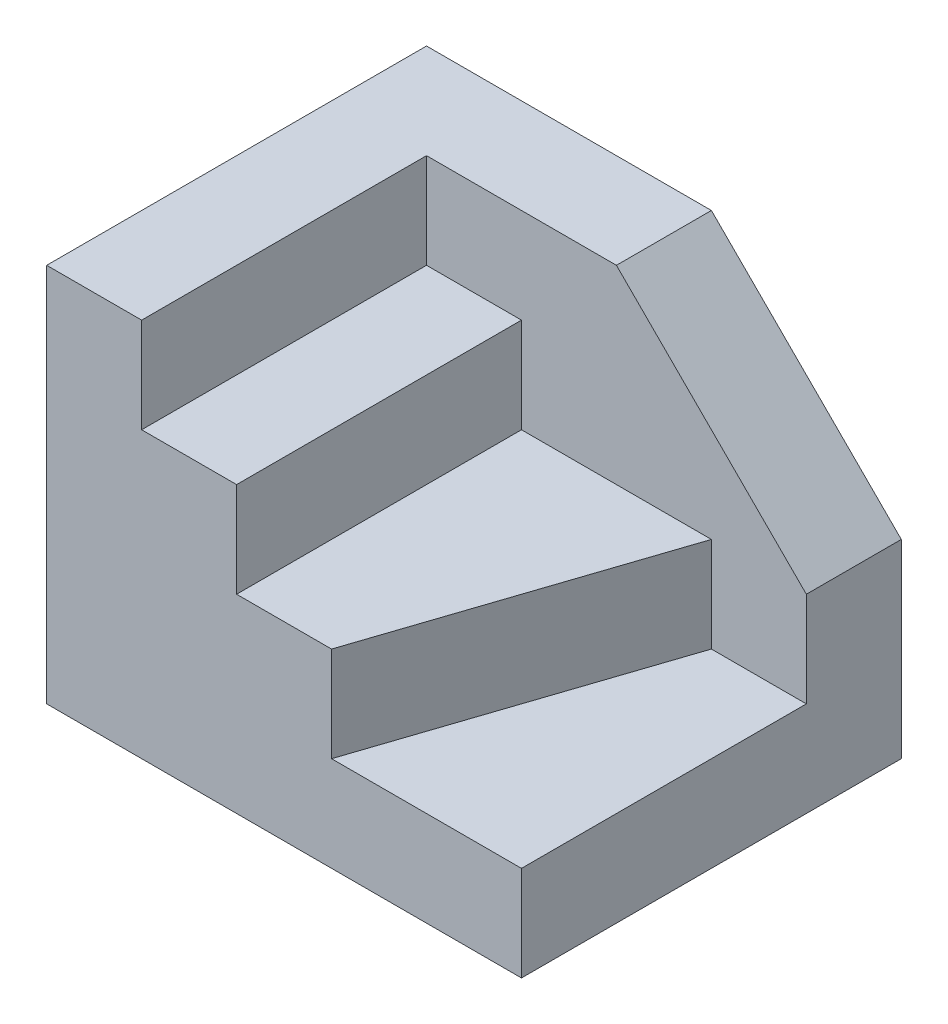
ISO-10303-21;
HEADER;
FILE_DESCRIPTION(('STEP AP214'),'2;1');
FILE_NAME('part.step','',(''),(''),'','','');
FILE_SCHEMA(('AUTOMOTIVE_DESIGN { 1 0 10303 214 1 1 1 1 }'));
ENDSEC;
DATA;
#1=APPLICATION_CONTEXT('core data for automotive mechanical design processes');
#2=APPLICATION_PROTOCOL_DEFINITION('international standard','automotive_design',2000,#1);
#3=PRODUCT_CONTEXT('',#1,'mechanical');
#4=PRODUCT('Part','Part','',(#3));
#5=PRODUCT_RELATED_PRODUCT_CATEGORY('part','',(#4));
#6=PRODUCT_DEFINITION_FORMATION('','',#4);
#7=PRODUCT_DEFINITION_CONTEXT('part definition',#1,'design');
#8=PRODUCT_DEFINITION('design','',#6,#7);
#9=PRODUCT_DEFINITION_SHAPE('','',#8);
#10=(LENGTH_UNIT() NAMED_UNIT(*) SI_UNIT(.MILLI.,.METRE.));
#11=(NAMED_UNIT(*) PLANE_ANGLE_UNIT() SI_UNIT($,.RADIAN.));
#12=(NAMED_UNIT(*) SI_UNIT($,.STERADIAN.) SOLID_ANGLE_UNIT());
#13=UNCERTAINTY_MEASURE_WITH_UNIT(LENGTH_MEASURE(1.E-05),#10,'distance_accuracy_value','');
#14=(GEOMETRIC_REPRESENTATION_CONTEXT(3) GLOBAL_UNCERTAINTY_ASSIGNED_CONTEXT((#13)) GLOBAL_UNIT_ASSIGNED_CONTEXT((#10,
#11,#12)) REPRESENTATION_CONTEXT('',''));
#15=CARTESIAN_POINT('',(0.,0.,0.));
#16=DIRECTION('',(0.,0.,1.));
#17=DIRECTION('',(1.,0.,0.));
#18=AXIS2_PLACEMENT_3D('',#15,#16,#17);
#19=CARTESIAN_POINT('',(-25.,40.,20.));
#20=DIRECTION('',(1.,0.,0.));
#21=DIRECTION('',(0.,0.,-1.));
#22=AXIS2_PLACEMENT_3D('',#19,#20,#21);
#23=PLANE('',#22);
#24=DIRECTION('',(0.,0.,1.));
#25=VECTOR('',#24,1.);
#26=CARTESIAN_POINT('',(-25.,0.,20.));
#27=LINE('',#26,#25);
#28=CARTESIAN_POINT('',(-25.,0.,-20.));
#29=VERTEX_POINT('',#28);
#30=CARTESIAN_POINT('',(-25.,0.,20.));
#31=VERTEX_POINT('',#30);
#32=EDGE_CURVE('E102',#29,#31,#27,.T.);
#33=ORIENTED_EDGE('',*,*,#32,.T.);
#34=DIRECTION('',(0.,-1.,0.));
#35=VECTOR('',#34,1.);
#36=CARTESIAN_POINT('',(-25.,40.,20.));
#37=LINE('',#36,#35);
#38=CARTESIAN_POINT('',(-25.,40.,20.));
#39=VERTEX_POINT('',#38);
#40=EDGE_CURVE('E12',#39,#31,#37,.T.);
#41=ORIENTED_EDGE('',*,*,#40,.F.);
#42=DIRECTION('',(0.,0.,1.));
#43=VECTOR('',#42,1.);
#44=CARTESIAN_POINT('',(-25.,40.,20.));
#45=LINE('',#44,#43);
#46=CARTESIAN_POINT('',(-25.,40.,-20.));
#47=VERTEX_POINT('',#46);
#48=EDGE_CURVE('E96',#47,#39,#45,.T.);
#49=ORIENTED_EDGE('',*,*,#48,.F.);
#50=DIRECTION('',(0.,-1.,0.));
#51=VECTOR('',#50,1.);
#52=CARTESIAN_POINT('',(-25.,40.,-20.));
#53=LINE('',#52,#51);
#54=EDGE_CURVE('E86',#47,#29,#53,.T.);
#55=ORIENTED_EDGE('',*,*,#54,.T.);
#56=EDGE_LOOP('',(#33,#41,#49,#55));
#57=FACE_BOUND('',#56,.T.);
#58=ADVANCED_FACE('F41',(#57),#23,.F.);
#59=CARTESIAN_POINT('',(25.,40.,20.));
#60=DIRECTION('',(0.,0.,-1.));
#61=DIRECTION('',(-1.,0.,0.));
#62=AXIS2_PLACEMENT_3D('',#59,#60,#61);
#63=PLANE('',#62);
#64=DIRECTION('',(1.,0.,0.));
#65=VECTOR('',#64,1.);
#66=CARTESIAN_POINT('',(5.,10.,20.));
#67=LINE('',#66,#65);
#68=CARTESIAN_POINT('',(5.,10.,20.));
#69=VERTEX_POINT('',#68);
#70=CARTESIAN_POINT('',(25.,10.,20.));
#71=VERTEX_POINT('',#70);
#72=EDGE_CURVE('E212',#69,#71,#67,.T.);
#73=ORIENTED_EDGE('',*,*,#72,.F.);
#74=DIRECTION('',(0.,1.,0.));
#75=VECTOR('',#74,1.);
#76=CARTESIAN_POINT('',(5.,10.,20.));
#77=LINE('',#76,#75);
#78=CARTESIAN_POINT('',(5.,20.,20.));
#79=VERTEX_POINT('',#78);
#80=EDGE_CURVE('E179',#69,#79,#77,.T.);
#81=ORIENTED_EDGE('',*,*,#80,.T.);
#82=DIRECTION('',(1.,0.,0.));
#83=VECTOR('',#82,1.);
#84=CARTESIAN_POINT('',(-5.,20.,20.));
#85=LINE('',#84,#83);
#86=CARTESIAN_POINT('',(-5.,20.,20.));
#87=VERTEX_POINT('',#86);
#88=EDGE_CURVE('E153',#87,#79,#85,.T.);
#89=ORIENTED_EDGE('',*,*,#88,.F.);
#90=DIRECTION('',(0.,-1.,0.));
#91=VECTOR('',#90,1.);
#92=CARTESIAN_POINT('',(-4.99999999999999,30.,20.));
#93=LINE('',#92,#91);
#94=CARTESIAN_POINT('',(-4.99999999999999,30.,20.));
#95=VERTEX_POINT('',#94);
#96=EDGE_CURVE('E169',#95,#87,#93,.T.);
#97=ORIENTED_EDGE('',*,*,#96,.F.);
#98=DIRECTION('',(1.,0.,0.));
#99=VECTOR('',#98,1.);
#100=CARTESIAN_POINT('',(-15.,30.,20.));
#101=LINE('',#100,#99);
#102=CARTESIAN_POINT('',(-15.,30.,20.));
#103=VERTEX_POINT('',#102);
#104=EDGE_CURVE('E173',#103,#95,#101,.T.);
#105=ORIENTED_EDGE('',*,*,#104,.F.);
#106=DIRECTION('',(0.,-1.,0.));
#107=VECTOR('',#106,1.);
#108=CARTESIAN_POINT('',(-15.,40.,20.));
#109=LINE('',#108,#107);
#110=CARTESIAN_POINT('',(-15.,40.,20.));
#111=VERTEX_POINT('',#110);
#112=EDGE_CURVE('E141',#111,#103,#109,.T.);
#113=ORIENTED_EDGE('',*,*,#112,.F.);
#114=DIRECTION('',(1.,0.,0.));
#115=VECTOR('',#114,1.);
#116=CARTESIAN_POINT('',(25.,40.,20.));
#117=LINE('',#116,#115);
#118=EDGE_CURVE('E137',#39,#111,#117,.T.);
#119=ORIENTED_EDGE('',*,*,#118,.F.);
#120=ORIENTED_EDGE('',*,*,#40,.T.);
#121=DIRECTION('',(1.,0.,0.));
#122=VECTOR('',#121,1.);
#123=CARTESIAN_POINT('',(25.,0.,20.));
#124=LINE('',#123,#122);
#125=CARTESIAN_POINT('',(25.,0.,20.));
#126=VERTEX_POINT('',#125);
#127=EDGE_CURVE('E107',#31,#126,#124,.T.);
#128=ORIENTED_EDGE('',*,*,#127,.T.);
#129=DIRECTION('',(0.,-1.,0.));
#130=VECTOR('',#129,1.);
#131=CARTESIAN_POINT('',(25.,40.,20.));
#132=LINE('',#131,#130);
#133=EDGE_CURVE('E49',#71,#126,#132,.T.);
#134=ORIENTED_EDGE('',*,*,#133,.F.);
#135=EDGE_LOOP('',(#73,#81,#89,#97,#105,#113,#119,#120,#128,#134));
#136=FACE_BOUND('',#135,.T.);
#137=ADVANCED_FACE('F134',(#136),#63,.F.);
#138=CARTESIAN_POINT('',(25.,40.,20.));
#139=DIRECTION('',(-1.,0.,0.));
#140=DIRECTION('',(0.,0.,1.));
#141=AXIS2_PLACEMENT_3D('',#138,#139,#140);
#142=PLANE('',#141);
#143=DIRECTION('',(0.,-1.,0.));
#144=VECTOR('',#143,1.);
#145=CARTESIAN_POINT('',(25.,40.,-20.));
#146=LINE('',#145,#144);
#147=CARTESIAN_POINT('',(25.,19.9999999999998,-20.));
#148=VERTEX_POINT('',#147);
#149=CARTESIAN_POINT('',(25.,0.,-20.));
#150=VERTEX_POINT('',#149);
#151=EDGE_CURVE('E90',#148,#150,#146,.T.);
#152=ORIENTED_EDGE('',*,*,#151,.F.);
#153=DIRECTION('',(0.,0.,1.));
#154=VECTOR('',#153,1.);
#155=CARTESIAN_POINT('',(25.,19.9999999999998,-20.));
#156=LINE('',#155,#154);
#157=CARTESIAN_POINT('',(25.,19.9999999999998,-10.));
#158=VERTEX_POINT('',#157);
#159=EDGE_CURVE('E209',#148,#158,#156,.T.);
#160=ORIENTED_EDGE('',*,*,#159,.T.);
#161=DIRECTION('',(0.,-1.,0.));
#162=VECTOR('',#161,1.);
#163=CARTESIAN_POINT('',(25.,40.,-10.));
#164=LINE('',#163,#162);
#165=CARTESIAN_POINT('',(25.,10.,-10.));
#166=VERTEX_POINT('',#165);
#167=EDGE_CURVE('E183',#158,#166,#164,.T.);
#168=ORIENTED_EDGE('',*,*,#167,.T.);
#169=DIRECTION('',(0.,0.,-1.));
#170=VECTOR('',#169,1.);
#171=CARTESIAN_POINT('',(25.,10.,20.));
#172=LINE('',#171,#170);
#173=EDGE_CURVE('E131',#71,#166,#172,.T.);
#174=ORIENTED_EDGE('',*,*,#173,.F.);
#175=ORIENTED_EDGE('',*,*,#133,.T.);
#176=DIRECTION('',(0.,0.,-1.));
#177=VECTOR('',#176,1.);
#178=CARTESIAN_POINT('',(25.,0.,20.));
#179=LINE('',#178,#177);
#180=EDGE_CURVE('E97',#126,#150,#179,.T.);
#181=ORIENTED_EDGE('',*,*,#180,.T.);
#182=EDGE_LOOP('',(#152,#160,#168,#174,#175,#181));
#183=FACE_BOUND('',#182,.T.);
#184=ADVANCED_FACE('F127',(#183),#142,.F.);
#185=CARTESIAN_POINT('',(25.,40.,-20.));
#186=DIRECTION('',(0.,0.,1.));
#187=DIRECTION('',(1.,0.,0.));
#188=AXIS2_PLACEMENT_3D('',#185,#186,#187);
#189=PLANE('',#188);
#190=DIRECTION('',(-1.,0.,0.));
#191=VECTOR('',#190,1.);
#192=CARTESIAN_POINT('',(25.,40.,-20.));
#193=LINE('',#192,#191);
#194=CARTESIAN_POINT('',(5.,40.,-20.));
#195=VERTEX_POINT('',#194);
#196=EDGE_CURVE('E64',#195,#47,#193,.T.);
#197=ORIENTED_EDGE('',*,*,#196,.F.);
#198=DIRECTION('',(0.707106781186544,-0.707106781186551,0.));
#199=VECTOR('',#198,1.);
#200=CARTESIAN_POINT('',(5.,40.,-20.));
#201=LINE('',#200,#199);
#202=EDGE_CURVE('E225',#195,#148,#201,.T.);
#203=ORIENTED_EDGE('',*,*,#202,.T.);
#204=ORIENTED_EDGE('',*,*,#151,.T.);
#205=DIRECTION('',(-1.,0.,0.));
#206=VECTOR('',#205,1.);
#207=CARTESIAN_POINT('',(25.,0.,-20.));
#208=LINE('',#207,#206);
#209=EDGE_CURVE('E83',#150,#29,#208,.T.);
#210=ORIENTED_EDGE('',*,*,#209,.T.);
#211=ORIENTED_EDGE('',*,*,#54,.F.);
#212=EDGE_LOOP('',(#197,#203,#204,#210,#211));
#213=FACE_BOUND('',#212,.T.);
#214=ADVANCED_FACE('F85',(#213),#189,.F.);
#215=CARTESIAN_POINT('',(0.,40.,0.));
#216=DIRECTION('',(0.,1.,0.));
#217=DIRECTION('',(0.,0.,1.));
#218=AXIS2_PLACEMENT_3D('',#215,#216,#217);
#219=PLANE('',#218);
#220=DIRECTION('',(0.,0.,1.));
#221=VECTOR('',#220,1.);
#222=CARTESIAN_POINT('',(5.,40.,-20.));
#223=LINE('',#222,#221);
#224=CARTESIAN_POINT('',(5.,40.,-10.));
#225=VERTEX_POINT('',#224);
#226=EDGE_CURVE('E56',#195,#225,#223,.T.);
#227=ORIENTED_EDGE('',*,*,#226,.F.);
#228=ORIENTED_EDGE('',*,*,#196,.T.);
#229=ORIENTED_EDGE('',*,*,#48,.T.);
#230=ORIENTED_EDGE('',*,*,#118,.T.);
#231=DIRECTION('',(0.,0.,1.));
#232=VECTOR('',#231,1.);
#233=CARTESIAN_POINT('',(-15.,40.,-64.7213595499958));
#234=LINE('',#233,#232);
#235=CARTESIAN_POINT('',(-15.,40.,-10.));
#236=VERTEX_POINT('',#235);
#237=EDGE_CURVE('E148',#236,#111,#234,.T.);
#238=ORIENTED_EDGE('',*,*,#237,.F.);
#239=DIRECTION('',(1.,0.,0.));
#240=VECTOR('',#239,1.);
#241=CARTESIAN_POINT('',(-15.,40.,-10.));
#242=LINE('',#241,#240);
#243=EDGE_CURVE('E115',#236,#225,#242,.T.);
#244=ORIENTED_EDGE('',*,*,#243,.T.);
#245=EDGE_LOOP('',(#227,#228,#229,#230,#238,#244));
#246=FACE_BOUND('',#245,.T.);
#247=ADVANCED_FACE('F144',(#246),#219,.T.);
#248=CARTESIAN_POINT('',(0.,0.,0.));
#249=DIRECTION('',(0.,1.,0.));
#250=DIRECTION('',(0.,0.,1.));
#251=AXIS2_PLACEMENT_3D('',#248,#249,#250);
#252=PLANE('',#251);
#253=ORIENTED_EDGE('',*,*,#32,.F.);
#254=ORIENTED_EDGE('',*,*,#209,.F.);
#255=ORIENTED_EDGE('',*,*,#180,.F.);
#256=ORIENTED_EDGE('',*,*,#127,.F.);
#257=EDGE_LOOP('',(#253,#254,#255,#256));
#258=FACE_BOUND('',#257,.T.);
#259=ADVANCED_FACE('F105',(#258),#252,.F.);
#260=CARTESIAN_POINT('',(-5.,20.,-64.7213595499958));
#261=DIRECTION('',(0.,-1.,0.));
#262=DIRECTION('',(0.,0.,-1.));
#263=AXIS2_PLACEMENT_3D('',#260,#261,#262);
#264=PLANE('',#263);
#265=ORIENTED_EDGE('',*,*,#88,.T.);
#266=DIRECTION('',(-0.316227766016838,0.,0.948683298050514));
#267=VECTOR('',#266,1.);
#268=CARTESIAN_POINT('',(15.,20.,-10.));
#269=LINE('',#268,#267);
#270=CARTESIAN_POINT('',(15.,20.,-10.));
#271=VERTEX_POINT('',#270);
#272=EDGE_CURVE('E204',#271,#79,#269,.T.);
#273=ORIENTED_EDGE('',*,*,#272,.F.);
#274=DIRECTION('',(-1.,0.,0.));
#275=VECTOR('',#274,1.);
#276=CARTESIAN_POINT('',(-4.99999999999999,20.,-10.));
#277=LINE('',#276,#275);
#278=CARTESIAN_POINT('',(-5.,20.,-10.));
#279=VERTEX_POINT('',#278);
#280=EDGE_CURVE('E186',#271,#279,#277,.T.);
#281=ORIENTED_EDGE('',*,*,#280,.T.);
#282=DIRECTION('',(0.,0.,1.));
#283=VECTOR('',#282,1.);
#284=CARTESIAN_POINT('',(-5.,20.,-64.7213595499958));
#285=LINE('',#284,#283);
#286=EDGE_CURVE('E161',#279,#87,#285,.T.);
#287=ORIENTED_EDGE('',*,*,#286,.T.);
#288=EDGE_LOOP('',(#265,#273,#281,#287));
#289=FACE_BOUND('',#288,.T.);
#290=ADVANCED_FACE('F289',(#289),#264,.F.);
#291=CARTESIAN_POINT('',(-4.99999999999999,30.,-64.7213595499958));
#292=DIRECTION('',(-1.,0.,0.));
#293=DIRECTION('',(0.,-1.,0.));
#294=AXIS2_PLACEMENT_3D('',#291,#292,#293);
#295=PLANE('',#294);
#296=DIRECTION('',(0.,1.,0.));
#297=VECTOR('',#296,1.);
#298=CARTESIAN_POINT('',(-4.99999999999999,30.,-10.));
#299=LINE('',#298,#297);
#300=CARTESIAN_POINT('',(-4.99999999999999,30.,-10.));
#301=VERTEX_POINT('',#300);
#302=EDGE_CURVE('E190',#279,#301,#299,.T.);
#303=ORIENTED_EDGE('',*,*,#302,.T.);
#304=DIRECTION('',(0.,0.,1.));
#305=VECTOR('',#304,1.);
#306=CARTESIAN_POINT('',(-4.99999999999999,30.,-64.7213595499958));
#307=LINE('',#306,#305);
#308=EDGE_CURVE('E157',#301,#95,#307,.T.);
#309=ORIENTED_EDGE('',*,*,#308,.T.);
#310=ORIENTED_EDGE('',*,*,#96,.T.);
#311=ORIENTED_EDGE('',*,*,#286,.F.);
#312=EDGE_LOOP('',(#303,#309,#310,#311));
#313=FACE_BOUND('',#312,.T.);
#314=ADVANCED_FACE('F280',(#313),#295,.F.);
#315=CARTESIAN_POINT('',(-15.,30.,-64.7213595499958));
#316=DIRECTION('',(0.,-1.,0.));
#317=DIRECTION('',(0.,0.,-1.));
#318=AXIS2_PLACEMENT_3D('',#315,#316,#317);
#319=PLANE('',#318);
#320=DIRECTION('',(-1.,0.,0.));
#321=VECTOR('',#320,1.);
#322=CARTESIAN_POINT('',(-15.,30.,-10.));
#323=LINE('',#322,#321);
#324=CARTESIAN_POINT('',(-15.,30.,-10.));
#325=VERTEX_POINT('',#324);
#326=EDGE_CURVE('E165',#301,#325,#323,.T.);
#327=ORIENTED_EDGE('',*,*,#326,.T.);
#328=DIRECTION('',(0.,0.,1.));
#329=VECTOR('',#328,1.);
#330=CARTESIAN_POINT('',(-15.,30.,-64.7213595499958));
#331=LINE('',#330,#329);
#332=EDGE_CURVE('E152',#325,#103,#331,.T.);
#333=ORIENTED_EDGE('',*,*,#332,.T.);
#334=ORIENTED_EDGE('',*,*,#104,.T.);
#335=ORIENTED_EDGE('',*,*,#308,.F.);
#336=EDGE_LOOP('',(#327,#333,#334,#335));
#337=FACE_BOUND('',#336,.T.);
#338=ADVANCED_FACE('F285',(#337),#319,.F.);
#339=CARTESIAN_POINT('',(-15.,40.,-64.7213595499958));
#340=DIRECTION('',(-1.,0.,0.));
#341=DIRECTION('',(0.,-1.,0.));
#342=AXIS2_PLACEMENT_3D('',#339,#340,#341);
#343=PLANE('',#342);
#344=DIRECTION('',(0.,1.,0.));
#345=VECTOR('',#344,1.);
#346=CARTESIAN_POINT('',(-15.,40.,-10.));
#347=LINE('',#346,#345);
#348=EDGE_CURVE('E109',#325,#236,#347,.T.);
#349=ORIENTED_EDGE('',*,*,#348,.T.);
#350=ORIENTED_EDGE('',*,*,#237,.T.);
#351=ORIENTED_EDGE('',*,*,#112,.T.);
#352=ORIENTED_EDGE('',*,*,#332,.F.);
#353=EDGE_LOOP('',(#349,#350,#351,#352));
#354=FACE_BOUND('',#353,.T.);
#355=ADVANCED_FACE('F299',(#354),#343,.F.);
#356=CARTESIAN_POINT('',(25.,40.,-10.));
#357=DIRECTION('',(0.,0.,1.));
#358=DIRECTION('',(1.,0.,0.));
#359=AXIS2_PLACEMENT_3D('',#356,#357,#358);
#360=PLANE('',#359);
#361=DIRECTION('',(0.707106781186544,-0.707106781186551,0.));
#362=VECTOR('',#361,1.);
#363=CARTESIAN_POINT('',(5.,40.,-10.));
#364=LINE('',#363,#362);
#365=EDGE_CURVE('E229',#225,#158,#364,.T.);
#366=ORIENTED_EDGE('',*,*,#365,.F.);
#367=ORIENTED_EDGE('',*,*,#243,.F.);
#368=ORIENTED_EDGE('',*,*,#348,.F.);
#369=ORIENTED_EDGE('',*,*,#326,.F.);
#370=ORIENTED_EDGE('',*,*,#302,.F.);
#371=ORIENTED_EDGE('',*,*,#280,.F.);
#372=DIRECTION('',(0.,1.,0.));
#373=VECTOR('',#372,1.);
#374=CARTESIAN_POINT('',(15.,10.,-10.));
#375=LINE('',#374,#373);
#376=CARTESIAN_POINT('',(15.,10.,-10.));
#377=VERTEX_POINT('',#376);
#378=EDGE_CURVE('E197',#377,#271,#375,.T.);
#379=ORIENTED_EDGE('',*,*,#378,.F.);
#380=DIRECTION('',(-1.,0.,0.));
#381=VECTOR('',#380,1.);
#382=CARTESIAN_POINT('',(25.,10.,-10.));
#383=LINE('',#382,#381);
#384=EDGE_CURVE('E208',#166,#377,#383,.T.);
#385=ORIENTED_EDGE('',*,*,#384,.F.);
#386=ORIENTED_EDGE('',*,*,#167,.F.);
#387=EDGE_LOOP('',(#366,#367,#368,#369,#370,#371,#379,#385,#386));
#388=FACE_BOUND('',#387,.T.);
#389=ADVANCED_FACE('F244',(#388),#360,.T.);
#390=CARTESIAN_POINT('',(15.,10.,-10.));
#391=DIRECTION('',(-0.948683298050514,0.,-0.316227766016838));
#392=DIRECTION('',(-0.316227766016838,0.,0.948683298050514));
#393=AXIS2_PLACEMENT_3D('',#390,#391,#392);
#394=PLANE('',#393);
#395=ORIENTED_EDGE('',*,*,#272,.T.);
#396=ORIENTED_EDGE('',*,*,#80,.F.);
#397=DIRECTION('',(-0.316227766016838,0.,0.948683298050514));
#398=VECTOR('',#397,1.);
#399=CARTESIAN_POINT('',(15.,10.,-10.));
#400=LINE('',#399,#398);
#401=EDGE_CURVE('E216',#377,#69,#400,.T.);
#402=ORIENTED_EDGE('',*,*,#401,.F.);
#403=ORIENTED_EDGE('',*,*,#378,.T.);
#404=EDGE_LOOP('',(#395,#396,#402,#403));
#405=FACE_BOUND('',#404,.T.);
#406=ADVANCED_FACE('F290',(#405),#394,.F.);
#407=CARTESIAN_POINT('',(0.,10.,0.));
#408=DIRECTION('',(0.,-1.,0.));
#409=DIRECTION('',(0.,0.,-1.));
#410=AXIS2_PLACEMENT_3D('',#407,#408,#409);
#411=PLANE('',#410);
#412=ORIENTED_EDGE('',*,*,#384,.T.);
#413=ORIENTED_EDGE('',*,*,#401,.T.);
#414=ORIENTED_EDGE('',*,*,#72,.T.);
#415=ORIENTED_EDGE('',*,*,#173,.T.);
#416=EDGE_LOOP('',(#412,#413,#414,#415));
#417=FACE_BOUND('',#416,.T.);
#418=ADVANCED_FACE('F252',(#417),#411,.F.);
#419=CARTESIAN_POINT('',(5.,40.,-20.));
#420=DIRECTION('',(-0.707106781186551,-0.707106781186544,0.));
#421=DIRECTION('',(0.707106781186544,-0.707106781186551,0.));
#422=AXIS2_PLACEMENT_3D('',#419,#420,#421);
#423=PLANE('',#422);
#424=ORIENTED_EDGE('',*,*,#365,.T.);
#425=ORIENTED_EDGE('',*,*,#159,.F.);
#426=ORIENTED_EDGE('',*,*,#202,.F.);
#427=ORIENTED_EDGE('',*,*,#226,.T.);
#428=EDGE_LOOP('',(#424,#425,#426,#427));
#429=FACE_BOUND('',#428,.T.);
#430=ADVANCED_FACE('F297',(#429),#423,.F.);
#431=CLOSED_SHELL('',(#58,#137,#184,#214,#247,#259,#290,#314,#338,#355,#389,#406,#418,#430));
#432=MANIFOLD_SOLID_BREP('B2',#431);
#433=ADVANCED_BREP_SHAPE_REPRESENTATION('',(#18,#432),#14);
#434=SHAPE_DEFINITION_REPRESENTATION(#9,#433);
ENDSEC;
END-ISO-10303-21;
